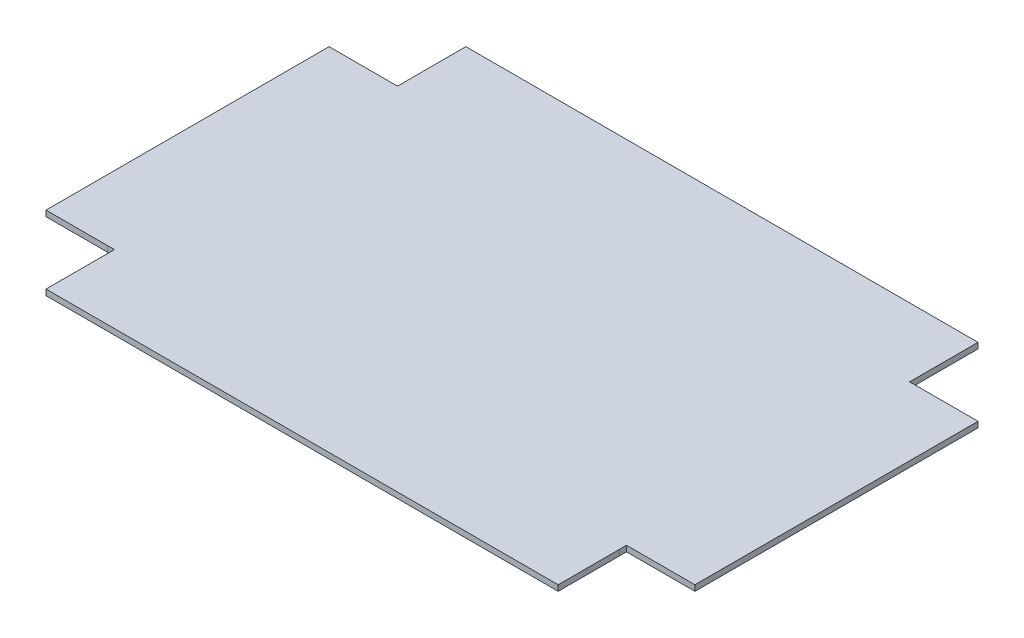
ISO-10303-21;
HEADER;
FILE_DESCRIPTION(('STEP AP214'),'2;1');
FILE_NAME('part.step','',(''),(''),'','','');
FILE_SCHEMA(('AUTOMOTIVE_DESIGN { 1 0 10303 214 1 1 1 1 }'));
ENDSEC;
DATA;
#1=APPLICATION_CONTEXT('core data for automotive mechanical design processes');
#2=APPLICATION_PROTOCOL_DEFINITION('international standard','automotive_design',2000,#1);
#3=PRODUCT_CONTEXT('',#1,'mechanical');
#4=PRODUCT('Part','Part','',(#3));
#5=PRODUCT_RELATED_PRODUCT_CATEGORY('part','',(#4));
#6=PRODUCT_DEFINITION_FORMATION('','',#4);
#7=PRODUCT_DEFINITION_CONTEXT('part definition',#1,'design');
#8=PRODUCT_DEFINITION('design','',#6,#7);
#9=PRODUCT_DEFINITION_SHAPE('','',#8);
#10=(LENGTH_UNIT() NAMED_UNIT(*) SI_UNIT(.MILLI.,.METRE.));
#11=(NAMED_UNIT(*) PLANE_ANGLE_UNIT() SI_UNIT($,.RADIAN.));
#12=(NAMED_UNIT(*) SI_UNIT($,.STERADIAN.) SOLID_ANGLE_UNIT());
#13=UNCERTAINTY_MEASURE_WITH_UNIT(LENGTH_MEASURE(1.E-05),#10,'distance_accuracy_value','');
#14=(GEOMETRIC_REPRESENTATION_CONTEXT(3) GLOBAL_UNCERTAINTY_ASSIGNED_CONTEXT((#13)) GLOBAL_UNIT_ASSIGNED_CONTEXT((#10,
#11,#12)) REPRESENTATION_CONTEXT('',''));
#15=CARTESIAN_POINT('',(0.,0.,0.));
#16=DIRECTION('',(0.,0.,1.));
#17=DIRECTION('',(1.,0.,0.));
#18=AXIS2_PLACEMENT_3D('',#15,#16,#17);
#19=CARTESIAN_POINT('',(0.,2.5,0.));
#20=DIRECTION('',(0.,-1.,0.));
#21=DIRECTION('',(0.,0.,-1.));
#22=AXIS2_PLACEMENT_3D('',#19,#20,#21);
#23=PLANE('',#22);
#24=DIRECTION('',(0.999955339391165,0.,-0.00945088477867864));
#25=VECTOR('',#24,1.);
#26=CARTESIAN_POINT('',(0.116056017189256,2.5,-3.20710678118655));
#27=LINE('',#26,#25);
#28=CARTESIAN_POINT('',(0.116056017189244,2.5,-3.20710678118655));
#29=VERTEX_POINT('',#28);
#30=CARTESIAN_POINT('',(3.2366,2.5,-3.23659999999999));
#31=VERTEX_POINT('',#30);
#32=EDGE_CURVE('E492',#29,#31,#27,.T.);
#33=ORIENTED_EDGE('',*,*,#32,.T.);
#34=DIRECTION('',(0.707106781186376,-5.09482385715369E-13,-0.707106781186719));
#35=VECTOR('',#34,1.);
#36=CARTESIAN_POINT('',(3.22185339059326,2.50000000000001,-3.22185339059327));
#37=LINE('',#36,#35);
#38=CARTESIAN_POINT('',(3.20710678118655,2.50000000000002,-3.20710678118654));
#39=VERTEX_POINT('',#38);
#40=EDGE_CURVE('E251',#39,#31,#37,.T.);
#41=ORIENTED_EDGE('',*,*,#40,.F.);
#42=DIRECTION('',(0.,0.,1.));
#43=VECTOR('',#42,1.);
#44=CARTESIAN_POINT('',(3.20710678118655,2.50000000000001,-3.35265601718925));
#45=LINE('',#44,#43);
#46=CARTESIAN_POINT('',(3.20710678118655,2.4999999999999,26.6473439828108));
#47=VERTEX_POINT('',#46);
#48=EDGE_CURVE('E403',#39,#47,#45,.T.);
#49=ORIENTED_EDGE('',*,*,#48,.T.);
#50=DIRECTION('',(1.,0.,0.));
#51=VECTOR('',#50,1.);
#52=CARTESIAN_POINT('',(0.,2.4999999999999,26.6473439828108));
#53=LINE('',#52,#51);
#54=CARTESIAN_POINT('',(226.792893218813,2.4999999999999,26.6473439828108));
#55=VERTEX_POINT('',#54);
#56=EDGE_CURVE('E448',#55,#47,#53,.F.);
#57=ORIENTED_EDGE('',*,*,#56,.F.);
#58=DIRECTION('',(0.,0.,-1.));
#59=VECTOR('',#58,1.);
#60=CARTESIAN_POINT('',(226.792893218813,2.5,-0.852656017189249));
#61=LINE('',#60,#59);
#62=CARTESIAN_POINT('',(226.792893218813,2.5,-0.116056017189252));
#63=VERTEX_POINT('',#62);
#64=EDGE_CURVE('E291',#63,#55,#61,.F.);
#65=ORIENTED_EDGE('',*,*,#64,.F.);
#66=DIRECTION('',(-0.00945088477868086,0.,-0.999955339391165));
#67=VECTOR('',#66,1.);
#68=CARTESIAN_POINT('',(226.792893218813,2.5,-0.116056017189257));
#69=LINE('',#68,#67);
#70=CARTESIAN_POINT('',(226.7634,2.5,-3.23660000000002));
#71=VERTEX_POINT('',#70);
#72=EDGE_CURVE('E294',#63,#71,#69,.T.);
#73=ORIENTED_EDGE('',*,*,#72,.T.);
#74=DIRECTION('',(-0.707106781186501,0.,-0.707106781186594));
#75=VECTOR('',#74,1.);
#76=CARTESIAN_POINT('',(226.778146609407,2.50000000000001,-3.22185339059327));
#77=LINE('',#76,#75);
#78=CARTESIAN_POINT('',(226.792893218813,2.50000000000001,-3.20710678118654));
#79=VERTEX_POINT('',#78);
#80=EDGE_CURVE('E428',#79,#71,#77,.T.);
#81=ORIENTED_EDGE('',*,*,#80,.F.);
#82=DIRECTION('',(1.,0.,0.));
#83=VECTOR('',#82,1.);
#84=CARTESIAN_POINT('',(226.64734398281,2.5,-3.20710678118654));
#85=LINE('',#84,#83);
#86=CARTESIAN_POINT('',(256.647343982811,2.49999999999981,-3.20710678118654));
#87=VERTEX_POINT('',#86);
#88=EDGE_CURVE('E467',#79,#87,#85,.T.);
#89=ORIENTED_EDGE('',*,*,#88,.T.);
#90=DIRECTION('',(0.,0.,-1.));
#91=VECTOR('',#90,1.);
#92=CARTESIAN_POINT('',(256.647343982811,2.49999999999981,0.));
#93=LINE('',#92,#91);
#94=CARTESIAN_POINT('',(256.647343982811,2.49999999999981,-126.792893218813));
#95=VERTEX_POINT('',#94);
#96=EDGE_CURVE('E464',#95,#87,#93,.F.);
#97=ORIENTED_EDGE('',*,*,#96,.F.);
#98=DIRECTION('',(-1.,0.,0.));
#99=VECTOR('',#98,1.);
#100=CARTESIAN_POINT('',(229.147343982811,2.5,-126.792893218813));
#101=LINE('',#100,#99);
#102=CARTESIAN_POINT('',(229.883943982811,2.5,-126.792893218813));
#103=VERTEX_POINT('',#102);
#104=EDGE_CURVE('E460',#103,#95,#101,.F.);
#105=ORIENTED_EDGE('',*,*,#104,.F.);
#106=DIRECTION('',(-0.999955339391165,0.,0.00945088477868083));
#107=VECTOR('',#106,1.);
#108=CARTESIAN_POINT('',(229.883943982811,2.5,-126.792893218813));
#109=LINE('',#108,#107);
#110=CARTESIAN_POINT('',(226.7634,2.5,-126.7634));
#111=VERTEX_POINT('',#110);
#112=EDGE_CURVE('E449',#103,#111,#109,.T.);
#113=ORIENTED_EDGE('',*,*,#112,.T.);
#114=DIRECTION('',(-0.707106781186547,-1.03975997084704E-13,0.707106781186547));
#115=VECTOR('',#114,1.);
#116=CARTESIAN_POINT('',(226.778146609407,2.5,-126.778146609407));
#117=LINE('',#116,#115);
#118=CARTESIAN_POINT('',(226.792893218813,2.5,-126.792893218813));
#119=VERTEX_POINT('',#118);
#120=EDGE_CURVE('E422',#119,#111,#117,.T.);
#121=ORIENTED_EDGE('',*,*,#120,.F.);
#122=DIRECTION('',(0.,0.,-1.));
#123=VECTOR('',#122,1.);
#124=CARTESIAN_POINT('',(226.792893218813,2.5,-126.64734398281));
#125=LINE('',#124,#123);
#126=CARTESIAN_POINT('',(226.792893218813,2.49999999999981,-156.647343982811));
#127=VERTEX_POINT('',#126);
#128=EDGE_CURVE('E494',#119,#127,#125,.T.);
#129=ORIENTED_EDGE('',*,*,#128,.T.);
#130=DIRECTION('',(-1.,0.,0.));
#131=VECTOR('',#130,1.);
#132=CARTESIAN_POINT('',(230.,2.49999999999981,-156.647343982811));
#133=LINE('',#132,#131);
#134=CARTESIAN_POINT('',(3.20710678118655,2.49999999999981,-156.647343982811));
#135=VERTEX_POINT('',#134);
#136=EDGE_CURVE('E491',#135,#127,#133,.F.);
#137=ORIENTED_EDGE('',*,*,#136,.F.);
#138=DIRECTION('',(0.,0.,1.));
#139=VECTOR('',#138,1.);
#140=CARTESIAN_POINT('',(3.20710678118654,2.5,-129.147343982811));
#141=LINE('',#140,#139);
#142=CARTESIAN_POINT('',(3.20710678118655,2.5,-129.883943982811));
#143=VERTEX_POINT('',#142);
#144=EDGE_CURVE('E487',#143,#135,#141,.F.);
#145=ORIENTED_EDGE('',*,*,#144,.F.);
#146=DIRECTION('',(0.00945088477868091,0.,0.999955339391165));
#147=VECTOR('',#146,1.);
#148=CARTESIAN_POINT('',(3.20710678118655,2.5,-129.883943982811));
#149=LINE('',#148,#147);
#150=CARTESIAN_POINT('',(3.2366,2.5,-126.7634));
#151=VERTEX_POINT('',#150);
#152=EDGE_CURVE('E465',#143,#151,#149,.T.);
#153=ORIENTED_EDGE('',*,*,#152,.T.);
#154=DIRECTION('',(0.707106781186496,0.,0.7071067811866));
#155=VECTOR('',#154,1.);
#156=CARTESIAN_POINT('',(3.22185339059327,2.5,-126.778146609407));
#157=LINE('',#156,#155);
#158=CARTESIAN_POINT('',(3.20710678118654,2.5,-126.792893218813));
#159=VERTEX_POINT('',#158);
#160=EDGE_CURVE('E412',#159,#151,#157,.T.);
#161=ORIENTED_EDGE('',*,*,#160,.F.);
#162=DIRECTION('',(-1.,0.,0.));
#163=VECTOR('',#162,1.);
#164=CARTESIAN_POINT('',(3.35265601718923,2.50000000000002,-126.792893218813));
#165=LINE('',#164,#163);
#166=CARTESIAN_POINT('',(-26.6473439828108,2.49999999999981,-126.792893218813));
#167=VERTEX_POINT('',#166);
#168=EDGE_CURVE('E521',#159,#167,#165,.T.);
#169=ORIENTED_EDGE('',*,*,#168,.T.);
#170=DIRECTION('',(0.,0.,1.));
#171=VECTOR('',#170,1.);
#172=CARTESIAN_POINT('',(-26.6473439828108,2.49999999999981,-130.));
#173=LINE('',#172,#171);
#174=CARTESIAN_POINT('',(-26.6473439828108,2.49999999999981,-3.20710678118655));
#175=VERTEX_POINT('',#174);
#176=EDGE_CURVE('E519',#175,#167,#173,.F.);
#177=ORIENTED_EDGE('',*,*,#176,.F.);
#178=DIRECTION('',(1.,0.,0.));
#179=VECTOR('',#178,1.);
#180=CARTESIAN_POINT('',(0.852656017189242,2.5,-3.20710678118654));
#181=LINE('',#180,#179);
#182=EDGE_CURVE('E514',#29,#175,#181,.F.);
#183=ORIENTED_EDGE('',*,*,#182,.F.);
#184=EDGE_LOOP('',(#33,#41,#49,#57,#65,#73,#81,#89,#97,#105,#113,#121,#129,#137,#145,#153,#161,
#169,#177,#183));
#185=FACE_BOUND('',#184,.T.);
#186=ADVANCED_FACE('F247',(#185),#23,.F.);
#187=CARTESIAN_POINT('',(0.,0.,0.));
#188=DIRECTION('',(0.,-1.,0.));
#189=DIRECTION('',(0.,0.,-1.));
#190=AXIS2_PLACEMENT_3D('',#187,#188,#189);
#191=PLANE('',#190);
#192=DIRECTION('',(-0.707106781186547,-1.03975997084704E-13,0.707106781186547));
#193=VECTOR('',#192,1.);
#194=CARTESIAN_POINT('',(226.778146609407,0.,-126.778146609407));
#195=LINE('',#194,#193);
#196=CARTESIAN_POINT('',(226.792893218813,0.,-126.792893218813));
#197=VERTEX_POINT('',#196);
#198=CARTESIAN_POINT('',(226.7634,0.,-126.7634));
#199=VERTEX_POINT('',#198);
#200=EDGE_CURVE('E425',#197,#199,#195,.T.);
#201=ORIENTED_EDGE('',*,*,#200,.T.);
#202=DIRECTION('',(-0.999955339391165,0.,0.00945088477868083));
#203=VECTOR('',#202,1.);
#204=CARTESIAN_POINT('',(229.883943982811,0.,-126.792893218813));
#205=LINE('',#204,#203);
#206=CARTESIAN_POINT('',(229.883943982811,0.,-126.792893218813));
#207=VERTEX_POINT('',#206);
#208=EDGE_CURVE('E458',#207,#199,#205,.T.);
#209=ORIENTED_EDGE('',*,*,#208,.F.);
#210=DIRECTION('',(1.,0.,0.));
#211=VECTOR('',#210,1.);
#212=CARTESIAN_POINT('',(226.64734398281,0.,-126.792893218813));
#213=LINE('',#212,#211);
#214=CARTESIAN_POINT('',(256.647343982811,-1.94289029309402E-13,-126.792893218813));
#215=VERTEX_POINT('',#214);
#216=EDGE_CURVE('E476',#207,#215,#213,.T.);
#217=ORIENTED_EDGE('',*,*,#216,.T.);
#218=DIRECTION('',(0.,0.,1.));
#219=VECTOR('',#218,1.);
#220=CARTESIAN_POINT('',(256.647343982811,-1.94289029309402E-13,0.));
#221=LINE('',#220,#219);
#222=CARTESIAN_POINT('',(256.647343982811,-1.94289029309402E-13,-3.20710678118654));
#223=VERTEX_POINT('',#222);
#224=EDGE_CURVE('E478',#215,#223,#221,.T.);
#225=ORIENTED_EDGE('',*,*,#224,.T.);
#226=DIRECTION('',(-1.,0.,0.));
#227=VECTOR('',#226,1.);
#228=CARTESIAN_POINT('',(229.147343982811,0.,-3.20710678118654));
#229=LINE('',#228,#227);
#230=CARTESIAN_POINT('',(226.792893218813,0.,-3.20710678118655));
#231=VERTEX_POINT('',#230);
#232=EDGE_CURVE('E470',#231,#223,#229,.F.);
#233=ORIENTED_EDGE('',*,*,#232,.F.);
#234=DIRECTION('',(-0.707106781186501,0.,-0.707106781186594));
#235=VECTOR('',#234,1.);
#236=CARTESIAN_POINT('',(226.778146609407,0.,-3.22185339059328));
#237=LINE('',#236,#235);
#238=CARTESIAN_POINT('',(226.7634,0.,-3.23660000000002));
#239=VERTEX_POINT('',#238);
#240=EDGE_CURVE('E431',#231,#239,#237,.T.);
#241=ORIENTED_EDGE('',*,*,#240,.T.);
#242=DIRECTION('',(-0.00945088477868086,0.,-0.999955339391165));
#243=VECTOR('',#242,1.);
#244=CARTESIAN_POINT('',(226.792893218813,0.,-0.116056017189257));
#245=LINE('',#244,#243);
#246=CARTESIAN_POINT('',(226.792893218813,0.,-0.116056017189261));
#247=VERTEX_POINT('',#246);
#248=EDGE_CURVE('E443',#247,#239,#245,.T.);
#249=ORIENTED_EDGE('',*,*,#248,.F.);
#250=DIRECTION('',(0.,0.,1.));
#251=VECTOR('',#250,1.);
#252=CARTESIAN_POINT('',(226.792893218813,0.,-3.35265601718926));
#253=LINE('',#252,#251);
#254=CARTESIAN_POINT('',(226.792893218813,0.,26.6473439828107));
#255=VERTEX_POINT('',#254);
#256=EDGE_CURVE('E283',#247,#255,#253,.T.);
#257=ORIENTED_EDGE('',*,*,#256,.T.);
#258=DIRECTION('',(-1.,0.,0.));
#259=VECTOR('',#258,1.);
#260=CARTESIAN_POINT('',(0.,0.,26.6473439828107));
#261=LINE('',#260,#259);
#262=CARTESIAN_POINT('',(3.20710678118655,0.,26.6473439828107));
#263=VERTEX_POINT('',#262);
#264=EDGE_CURVE('E266',#255,#263,#261,.T.);
#265=ORIENTED_EDGE('',*,*,#264,.T.);
#266=DIRECTION('',(0.,0.,-1.));
#267=VECTOR('',#266,1.);
#268=CARTESIAN_POINT('',(3.20710678118655,0.,-0.852656017189258));
#269=LINE('',#268,#267);
#270=CARTESIAN_POINT('',(3.20710678118656,0.,-3.20710678118654));
#271=VERTEX_POINT('',#270);
#272=EDGE_CURVE('E393',#271,#263,#269,.F.);
#273=ORIENTED_EDGE('',*,*,#272,.F.);
#274=DIRECTION('',(0.707106781186376,-5.09482385715369E-13,-0.707106781186719));
#275=VECTOR('',#274,1.);
#276=CARTESIAN_POINT('',(3.22185339059328,0.,-3.22185339059327));
#277=LINE('',#276,#275);
#278=CARTESIAN_POINT('',(3.2366,0.,-3.23659999999999));
#279=VERTEX_POINT('',#278);
#280=EDGE_CURVE('E398',#271,#279,#277,.T.);
#281=ORIENTED_EDGE('',*,*,#280,.T.);
#282=DIRECTION('',(0.999955339391165,0.,-0.00945088477867864));
#283=VECTOR('',#282,1.);
#284=CARTESIAN_POINT('',(0.116056017189256,0.,-3.20710678118655));
#285=LINE('',#284,#283);
#286=CARTESIAN_POINT('',(0.116056017189262,0.,-3.20710678118655));
#287=VERTEX_POINT('',#286);
#288=EDGE_CURVE('E512',#287,#279,#285,.T.);
#289=ORIENTED_EDGE('',*,*,#288,.F.);
#290=DIRECTION('',(-1.,0.,0.));
#291=VECTOR('',#290,1.);
#292=CARTESIAN_POINT('',(3.35265601718926,0.,-3.20710678118654));
#293=LINE('',#292,#291);
#294=CARTESIAN_POINT('',(-26.6473439828107,-1.89973241225849E-13,-3.20710678118655));
#295=VERTEX_POINT('',#294);
#296=EDGE_CURVE('E530',#287,#295,#293,.T.);
#297=ORIENTED_EDGE('',*,*,#296,.T.);
#298=DIRECTION('',(0.,0.,-1.));
#299=VECTOR('',#298,1.);
#300=CARTESIAN_POINT('',(-26.6473439828107,-1.89973241225849E-13,0.));
#301=LINE('',#300,#299);
#302=CARTESIAN_POINT('',(-26.6473439828107,-1.89954214582446E-13,-126.792893218813));
#303=VERTEX_POINT('',#302);
#304=EDGE_CURVE('E532',#295,#303,#301,.T.);
#305=ORIENTED_EDGE('',*,*,#304,.T.);
#306=DIRECTION('',(1.,0.,0.));
#307=VECTOR('',#306,1.);
#308=CARTESIAN_POINT('',(0.852656017189259,0.,-126.792893218813));
#309=LINE('',#308,#307);
#310=CARTESIAN_POINT('',(3.20710678118654,0.,-126.792893218813));
#311=VERTEX_POINT('',#310);
#312=EDGE_CURVE('E524',#311,#303,#309,.F.);
#313=ORIENTED_EDGE('',*,*,#312,.F.);
#314=DIRECTION('',(0.707106781186496,0.,0.7071067811866));
#315=VECTOR('',#314,1.);
#316=CARTESIAN_POINT('',(3.22185339059327,0.,-126.778146609407));
#317=LINE('',#316,#315);
#318=CARTESIAN_POINT('',(3.2366,0.,-126.7634));
#319=VERTEX_POINT('',#318);
#320=EDGE_CURVE('E418',#311,#319,#317,.T.);
#321=ORIENTED_EDGE('',*,*,#320,.T.);
#322=DIRECTION('',(0.00945088477868091,0.,0.999955339391165));
#323=VECTOR('',#322,1.);
#324=CARTESIAN_POINT('',(3.20710678118655,0.,-129.883943982811));
#325=LINE('',#324,#323);
#326=CARTESIAN_POINT('',(3.20710678118654,0.,-129.883943982811));
#327=VERTEX_POINT('',#326);
#328=EDGE_CURVE('E485',#327,#319,#325,.T.);
#329=ORIENTED_EDGE('',*,*,#328,.F.);
#330=DIRECTION('',(0.,0.,-1.));
#331=VECTOR('',#330,1.);
#332=CARTESIAN_POINT('',(3.20710678118654,0.,-126.64734398281));
#333=LINE('',#332,#331);
#334=CARTESIAN_POINT('',(3.20710678118655,-1.94289029309402E-13,-156.647343982811));
#335=VERTEX_POINT('',#334);
#336=EDGE_CURVE('E503',#327,#335,#333,.T.);
#337=ORIENTED_EDGE('',*,*,#336,.T.);
#338=DIRECTION('',(1.,0.,0.));
#339=VECTOR('',#338,1.);
#340=CARTESIAN_POINT('',(0.,-1.94289029309402E-13,-156.647343982811));
#341=LINE('',#340,#339);
#342=CARTESIAN_POINT('',(226.792893218813,-1.94289029309402E-13,-156.647343982811));
#343=VERTEX_POINT('',#342);
#344=EDGE_CURVE('E505',#335,#343,#341,.T.);
#345=ORIENTED_EDGE('',*,*,#344,.T.);
#346=DIRECTION('',(0.,0.,1.));
#347=VECTOR('',#346,1.);
#348=CARTESIAN_POINT('',(226.792893218813,0.,-129.147343982811));
#349=LINE('',#348,#347);
#350=EDGE_CURVE('E497',#197,#343,#349,.F.);
#351=ORIENTED_EDGE('',*,*,#350,.F.);
#352=EDGE_LOOP('',(#201,#209,#217,#225,#233,#241,#249,#257,#265,#273,#281,#289,#297,#305,#313,
#321,#329,#337,#345,#351));
#353=FACE_BOUND('',#352,.T.);
#354=ADVANCED_FACE('F249',(#353),#191,.T.);
#355=CARTESIAN_POINT('',(226.792893218813,1.25,-0.116056017189257));
#356=DIRECTION('',(0.999955339391165,0.,-0.00945088477868086));
#357=DIRECTION('',(-0.00945088477868086,0.,-0.999955339391165));
#358=AXIS2_PLACEMENT_3D('',#355,#356,#357);
#359=PLANE('',#358);
#360=ORIENTED_EDGE('',*,*,#248,.T.);
#361=DIRECTION('',(0.,-1.,0.));
#362=VECTOR('',#361,1.);
#363=CARTESIAN_POINT('',(226.7634,2.5,-3.23660000000001));
#364=LINE('',#363,#362);
#365=EDGE_CURVE('E440',#71,#239,#364,.T.);
#366=ORIENTED_EDGE('',*,*,#365,.F.);
#367=ORIENTED_EDGE('',*,*,#72,.F.);
#368=DIRECTION('',(0.,1.,0.));
#369=VECTOR('',#368,1.);
#370=CARTESIAN_POINT('',(226.792893218813,2.5,-0.116056017189252));
#371=LINE('',#370,#369);
#372=EDGE_CURVE('E455',#247,#63,#371,.T.);
#373=ORIENTED_EDGE('',*,*,#372,.F.);
#374=EDGE_LOOP('',(#360,#366,#367,#373));
#375=FACE_BOUND('',#374,.T.);
#376=ADVANCED_FACE('F574',(#375),#359,.T.);
#377=CARTESIAN_POINT('',(0.,0.,26.6473439828107));
#378=DIRECTION('',(0.,0.,-1.));
#379=DIRECTION('',(0.,1.,0.));
#380=AXIS2_PLACEMENT_3D('',#377,#378,#379);
#381=PLANE('',#380);
#382=ORIENTED_EDGE('',*,*,#264,.F.);
#383=DIRECTION('',(0.,1.,0.));
#384=VECTOR('',#383,1.);
#385=CARTESIAN_POINT('',(226.792893218813,0.,26.6473439828107));
#386=LINE('',#385,#384);
#387=EDGE_CURVE('E446',#255,#55,#386,.T.);
#388=ORIENTED_EDGE('',*,*,#387,.T.);
#389=ORIENTED_EDGE('',*,*,#56,.T.);
#390=DIRECTION('',(0.,-1.,0.));
#391=VECTOR('',#390,1.);
#392=CARTESIAN_POINT('',(3.20710678118655,2.4999999999999,26.6473439828108));
#393=LINE('',#392,#391);
#394=EDGE_CURVE('E402',#263,#47,#393,.F.);
#395=ORIENTED_EDGE('',*,*,#394,.F.);
#396=EDGE_LOOP('',(#382,#388,#389,#395));
#397=FACE_BOUND('',#396,.T.);
#398=ADVANCED_FACE('F625',(#397),#381,.F.);
#399=CARTESIAN_POINT('',(3.20710678118655,2.5,-0.852656017189249));
#400=DIRECTION('',(-1.,0.,0.));
#401=DIRECTION('',(0.,-1.,0.));
#402=AXIS2_PLACEMENT_3D('',#399,#400,#401);
#403=PLANE('',#402);
#404=ORIENTED_EDGE('',*,*,#272,.T.);
#405=ORIENTED_EDGE('',*,*,#394,.T.);
#406=ORIENTED_EDGE('',*,*,#48,.F.);
#407=DIRECTION('',(0.,1.,0.));
#408=VECTOR('',#407,1.);
#409=CARTESIAN_POINT('',(3.20710678118656,0.,-3.20710678118654));
#410=LINE('',#409,#408);
#411=EDGE_CURVE('E406',#271,#39,#410,.T.);
#412=ORIENTED_EDGE('',*,*,#411,.F.);
#413=EDGE_LOOP('',(#404,#405,#406,#412));
#414=FACE_BOUND('',#413,.T.);
#415=ADVANCED_FACE('F407',(#414),#403,.T.);
#416=CARTESIAN_POINT('',(226.792893218813,2.5,-0.852656017189249));
#417=DIRECTION('',(-1.,0.,0.));
#418=DIRECTION('',(0.,-1.,0.));
#419=AXIS2_PLACEMENT_3D('',#416,#417,#418);
#420=PLANE('',#419);
#421=ORIENTED_EDGE('',*,*,#387,.F.);
#422=ORIENTED_EDGE('',*,*,#256,.F.);
#423=ORIENTED_EDGE('',*,*,#372,.T.);
#424=ORIENTED_EDGE('',*,*,#64,.T.);
#425=EDGE_LOOP('',(#421,#422,#423,#424));
#426=FACE_BOUND('',#425,.T.);
#427=ADVANCED_FACE('F571',(#426),#420,.F.);
#428=CARTESIAN_POINT('',(229.883943982811,1.25,-126.792893218813));
#429=DIRECTION('',(-0.00945088477868083,0.,-0.999955339391165));
#430=DIRECTION('',(-0.999955339391165,0.,0.00945088477868083));
#431=AXIS2_PLACEMENT_3D('',#428,#429,#430);
#432=PLANE('',#431);
#433=ORIENTED_EDGE('',*,*,#208,.T.);
#434=DIRECTION('',(0.,-1.,0.));
#435=VECTOR('',#434,1.);
#436=CARTESIAN_POINT('',(226.7634,2.5,-126.7634));
#437=LINE('',#436,#435);
#438=EDGE_CURVE('E437',#111,#199,#437,.T.);
#439=ORIENTED_EDGE('',*,*,#438,.F.);
#440=ORIENTED_EDGE('',*,*,#112,.F.);
#441=DIRECTION('',(0.,1.,0.));
#442=VECTOR('',#441,1.);
#443=CARTESIAN_POINT('',(229.883943982811,2.5,-126.792893218813));
#444=LINE('',#443,#442);
#445=EDGE_CURVE('E480',#207,#103,#444,.T.);
#446=ORIENTED_EDGE('',*,*,#445,.F.);
#447=EDGE_LOOP('',(#433,#439,#440,#446));
#448=FACE_BOUND('',#447,.T.);
#449=ADVANCED_FACE('F594',(#448),#432,.T.);
#450=CARTESIAN_POINT('',(256.647343982811,-1.94289029309402E-13,0.));
#451=DIRECTION('',(-1.,0.,0.));
#452=DIRECTION('',(0.,-1.,0.));
#453=AXIS2_PLACEMENT_3D('',#450,#451,#452);
#454=PLANE('',#453);
#455=ORIENTED_EDGE('',*,*,#224,.F.);
#456=DIRECTION('',(0.,1.,0.));
#457=VECTOR('',#456,1.);
#458=CARTESIAN_POINT('',(256.647343982811,-1.94289029309402E-13,-126.792893218813));
#459=LINE('',#458,#457);
#460=EDGE_CURVE('E462',#215,#95,#459,.T.);
#461=ORIENTED_EDGE('',*,*,#460,.T.);
#462=ORIENTED_EDGE('',*,*,#96,.T.);
#463=DIRECTION('',(0.,-1.,0.));
#464=VECTOR('',#463,1.);
#465=CARTESIAN_POINT('',(256.647343982811,2.49999999999981,-3.20710678118654));
#466=LINE('',#465,#464);
#467=EDGE_CURVE('E473',#223,#87,#466,.F.);
#468=ORIENTED_EDGE('',*,*,#467,.F.);
#469=EDGE_LOOP('',(#455,#461,#462,#468));
#470=FACE_BOUND('',#469,.T.);
#471=ADVANCED_FACE('F585',(#470),#454,.F.);
#472=CARTESIAN_POINT('',(229.147343982811,2.5,-3.20710678118654));
#473=DIRECTION('',(0.,0.,1.));
#474=DIRECTION('',(-1.,0.,0.));
#475=AXIS2_PLACEMENT_3D('',#472,#473,#474);
#476=PLANE('',#475);
#477=ORIENTED_EDGE('',*,*,#232,.T.);
#478=ORIENTED_EDGE('',*,*,#467,.T.);
#479=ORIENTED_EDGE('',*,*,#88,.F.);
#480=DIRECTION('',(0.,1.,0.));
#481=VECTOR('',#480,1.);
#482=CARTESIAN_POINT('',(226.792893218813,0.,-3.20710678118655));
#483=LINE('',#482,#481);
#484=EDGE_CURVE('E433',#231,#79,#483,.T.);
#485=ORIENTED_EDGE('',*,*,#484,.F.);
#486=EDGE_LOOP('',(#477,#478,#479,#485));
#487=FACE_BOUND('',#486,.T.);
#488=ADVANCED_FACE('F581',(#487),#476,.T.);
#489=CARTESIAN_POINT('',(229.147343982811,2.5,-126.792893218813));
#490=DIRECTION('',(0.,0.,1.));
#491=DIRECTION('',(-1.,0.,0.));
#492=AXIS2_PLACEMENT_3D('',#489,#490,#491);
#493=PLANE('',#492);
#494=ORIENTED_EDGE('',*,*,#460,.F.);
#495=ORIENTED_EDGE('',*,*,#216,.F.);
#496=ORIENTED_EDGE('',*,*,#445,.T.);
#497=ORIENTED_EDGE('',*,*,#104,.T.);
#498=EDGE_LOOP('',(#494,#495,#496,#497));
#499=FACE_BOUND('',#498,.T.);
#500=ADVANCED_FACE('F588',(#499),#493,.F.);
#501=CARTESIAN_POINT('',(3.20710678118655,1.25,-129.883943982811));
#502=DIRECTION('',(-0.999955339391165,0.,0.00945088477868091));
#503=DIRECTION('',(0.00945088477868091,0.,0.999955339391165));
#504=AXIS2_PLACEMENT_3D('',#501,#502,#503);
#505=PLANE('',#504);
#506=ORIENTED_EDGE('',*,*,#328,.T.);
#507=DIRECTION('',(0.,-1.,0.));
#508=VECTOR('',#507,1.);
#509=CARTESIAN_POINT('',(3.2366,2.5,-126.7634));
#510=LINE('',#509,#508);
#511=EDGE_CURVE('E257',#151,#319,#510,.T.);
#512=ORIENTED_EDGE('',*,*,#511,.F.);
#513=ORIENTED_EDGE('',*,*,#152,.F.);
#514=DIRECTION('',(0.,1.,0.));
#515=VECTOR('',#514,1.);
#516=CARTESIAN_POINT('',(3.20710678118654,2.5,-129.883943982811));
#517=LINE('',#516,#515);
#518=EDGE_CURVE('E507',#327,#143,#517,.T.);
#519=ORIENTED_EDGE('',*,*,#518,.F.);
#520=EDGE_LOOP('',(#506,#512,#513,#519));
#521=FACE_BOUND('',#520,.T.);
#522=ADVANCED_FACE('F556',(#521),#505,.T.);
#523=CARTESIAN_POINT('',(230.,-1.94289029309402E-13,-156.647343982811));
#524=DIRECTION('',(0.,0.,1.));
#525=DIRECTION('',(0.,-1.,0.));
#526=AXIS2_PLACEMENT_3D('',#523,#524,#525);
#527=PLANE('',#526);
#528=ORIENTED_EDGE('',*,*,#344,.F.);
#529=DIRECTION('',(0.,1.,0.));
#530=VECTOR('',#529,1.);
#531=CARTESIAN_POINT('',(3.20710678118655,-1.94289029309402E-13,-156.647343982811));
#532=LINE('',#531,#530);
#533=EDGE_CURVE('E489',#335,#135,#532,.T.);
#534=ORIENTED_EDGE('',*,*,#533,.T.);
#535=ORIENTED_EDGE('',*,*,#136,.T.);
#536=DIRECTION('',(0.,-1.,0.));
#537=VECTOR('',#536,1.);
#538=CARTESIAN_POINT('',(226.792893218813,2.49999999999981,-156.647343982811));
#539=LINE('',#538,#537);
#540=EDGE_CURVE('E500',#343,#127,#539,.F.);
#541=ORIENTED_EDGE('',*,*,#540,.F.);
#542=EDGE_LOOP('',(#528,#534,#535,#541));
#543=FACE_BOUND('',#542,.T.);
#544=ADVANCED_FACE('F608',(#543),#527,.F.);
#545=CARTESIAN_POINT('',(226.792893218813,2.5,-129.147343982811));
#546=DIRECTION('',(1.,0.,0.));
#547=DIRECTION('',(0.,-1.,0.));
#548=AXIS2_PLACEMENT_3D('',#545,#546,#547);
#549=PLANE('',#548);
#550=ORIENTED_EDGE('',*,*,#350,.T.);
#551=ORIENTED_EDGE('',*,*,#540,.T.);
#552=ORIENTED_EDGE('',*,*,#128,.F.);
#553=DIRECTION('',(0.,1.,0.));
#554=VECTOR('',#553,1.);
#555=CARTESIAN_POINT('',(226.792893218813,0.,-126.792893218813));
#556=LINE('',#555,#554);
#557=EDGE_CURVE('E427',#197,#119,#556,.T.);
#558=ORIENTED_EDGE('',*,*,#557,.F.);
#559=EDGE_LOOP('',(#550,#551,#552,#558));
#560=FACE_BOUND('',#559,.T.);
#561=ADVANCED_FACE('F601',(#560),#549,.T.);
#562=CARTESIAN_POINT('',(3.20710678118654,2.5,-129.147343982811));
#563=DIRECTION('',(1.,0.,0.));
#564=DIRECTION('',(0.,-1.,0.));
#565=AXIS2_PLACEMENT_3D('',#562,#563,#564);
#566=PLANE('',#565);
#567=ORIENTED_EDGE('',*,*,#533,.F.);
#568=ORIENTED_EDGE('',*,*,#336,.F.);
#569=ORIENTED_EDGE('',*,*,#518,.T.);
#570=ORIENTED_EDGE('',*,*,#144,.T.);
#571=EDGE_LOOP('',(#567,#568,#569,#570));
#572=FACE_BOUND('',#571,.T.);
#573=ADVANCED_FACE('F606',(#572),#566,.F.);
#574=CARTESIAN_POINT('',(0.116056017189256,1.25,-3.20710678118655));
#575=DIRECTION('',(0.00945088477867864,0.,0.999955339391165));
#576=DIRECTION('',(0.999955339391165,0.,-0.00945088477867864));
#577=AXIS2_PLACEMENT_3D('',#574,#575,#576);
#578=PLANE('',#577);
#579=ORIENTED_EDGE('',*,*,#288,.T.);
#580=DIRECTION('',(0.,-1.,0.));
#581=VECTOR('',#580,1.);
#582=CARTESIAN_POINT('',(3.2366,2.5,-3.2366));
#583=LINE('',#582,#581);
#584=EDGE_CURVE('E14',#31,#279,#583,.T.);
#585=ORIENTED_EDGE('',*,*,#584,.F.);
#586=ORIENTED_EDGE('',*,*,#32,.F.);
#587=DIRECTION('',(0.,1.,0.));
#588=VECTOR('',#587,1.);
#589=CARTESIAN_POINT('',(0.116056017189244,2.5,-3.20710678118654));
#590=LINE('',#589,#588);
#591=EDGE_CURVE('E534',#287,#29,#590,.T.);
#592=ORIENTED_EDGE('',*,*,#591,.F.);
#593=EDGE_LOOP('',(#579,#585,#586,#592));
#594=FACE_BOUND('',#593,.T.);
#595=ADVANCED_FACE('F569',(#594),#578,.T.);
#596=CARTESIAN_POINT('',(-26.6473439828107,-1.89745890488158E-13,-130.));
#597=DIRECTION('',(1.,0.,0.));
#598=DIRECTION('',(0.,1.,0.));
#599=AXIS2_PLACEMENT_3D('',#596,#597,#598);
#600=PLANE('',#599);
#601=ORIENTED_EDGE('',*,*,#304,.F.);
#602=DIRECTION('',(0.,1.,0.));
#603=VECTOR('',#602,1.);
#604=CARTESIAN_POINT('',(-26.6473439828107,-1.89745890488158E-13,-3.20710678118655));
#605=LINE('',#604,#603);
#606=EDGE_CURVE('E517',#295,#175,#605,.T.);
#607=ORIENTED_EDGE('',*,*,#606,.T.);
#608=ORIENTED_EDGE('',*,*,#176,.T.);
#609=DIRECTION('',(0.,-1.,0.));
#610=VECTOR('',#609,1.);
#611=CARTESIAN_POINT('',(-26.6473439828108,2.49999999999981,-126.792893218813));
#612=LINE('',#611,#610);
#613=EDGE_CURVE('E527',#303,#167,#612,.F.);
#614=ORIENTED_EDGE('',*,*,#613,.F.);
#615=EDGE_LOOP('',(#601,#607,#608,#614));
#616=FACE_BOUND('',#615,.T.);
#617=ADVANCED_FACE('F562',(#616),#600,.F.);
#618=CARTESIAN_POINT('',(0.852656017189242,2.5,-126.792893218813));
#619=DIRECTION('',(0.,0.,-1.));
#620=DIRECTION('',(-1.,0.,0.));
#621=AXIS2_PLACEMENT_3D('',#618,#619,#620);
#622=PLANE('',#621);
#623=ORIENTED_EDGE('',*,*,#312,.T.);
#624=ORIENTED_EDGE('',*,*,#613,.T.);
#625=ORIENTED_EDGE('',*,*,#168,.F.);
#626=DIRECTION('',(0.,1.,0.));
#627=VECTOR('',#626,1.);
#628=CARTESIAN_POINT('',(3.20710678118654,0.,-126.792893218813));
#629=LINE('',#628,#627);
#630=EDGE_CURVE('E421',#311,#159,#629,.T.);
#631=ORIENTED_EDGE('',*,*,#630,.F.);
#632=EDGE_LOOP('',(#623,#624,#625,#631));
#633=FACE_BOUND('',#632,.T.);
#634=ADVANCED_FACE('F560',(#633),#622,.T.);
#635=CARTESIAN_POINT('',(0.852656017189242,2.5,-3.20710678118654));
#636=DIRECTION('',(0.,0.,-1.));
#637=DIRECTION('',(-1.,0.,0.));
#638=AXIS2_PLACEMENT_3D('',#635,#636,#637);
#639=PLANE('',#638);
#640=ORIENTED_EDGE('',*,*,#606,.F.);
#641=ORIENTED_EDGE('',*,*,#296,.F.);
#642=ORIENTED_EDGE('',*,*,#591,.T.);
#643=ORIENTED_EDGE('',*,*,#182,.T.);
#644=EDGE_LOOP('',(#640,#641,#642,#643));
#645=FACE_BOUND('',#644,.T.);
#646=ADVANCED_FACE('F565',(#645),#639,.F.);
#647=CARTESIAN_POINT('',(226.792893218813,0.,-3.20710678118655));
#648=DIRECTION('',(0.707106781186594,0.,-0.707106781186501));
#649=DIRECTION('',(-0.707106781186501,0.,-0.707106781186594));
#650=AXIS2_PLACEMENT_3D('',#647,#648,#649);
#651=PLANE('',#650);
#652=ORIENTED_EDGE('',*,*,#80,.T.);
#653=ORIENTED_EDGE('',*,*,#365,.T.);
#654=ORIENTED_EDGE('',*,*,#240,.F.);
#655=ORIENTED_EDGE('',*,*,#484,.T.);
#656=EDGE_LOOP('',(#652,#653,#654,#655));
#657=FACE_BOUND('',#656,.T.);
#658=ADVANCED_FACE('F577',(#657),#651,.F.);
#659=CARTESIAN_POINT('',(226.792893218813,0.,-126.792893218813));
#660=DIRECTION('',(-0.707106781186547,0.,-0.707106781186547));
#661=DIRECTION('',(-0.707106781186548,0.,0.707106781186548));
#662=AXIS2_PLACEMENT_3D('',#659,#660,#661);
#663=PLANE('',#662);
#664=ORIENTED_EDGE('',*,*,#120,.T.);
#665=ORIENTED_EDGE('',*,*,#438,.T.);
#666=ORIENTED_EDGE('',*,*,#200,.F.);
#667=ORIENTED_EDGE('',*,*,#557,.T.);
#668=EDGE_LOOP('',(#664,#665,#666,#667));
#669=FACE_BOUND('',#668,.T.);
#670=ADVANCED_FACE('F598',(#669),#663,.F.);
#671=CARTESIAN_POINT('',(3.20710678118654,0.,-126.792893218813));
#672=DIRECTION('',(-0.7071067811866,0.,0.707106781186496));
#673=DIRECTION('',(0.707106781186496,0.,0.7071067811866));
#674=AXIS2_PLACEMENT_3D('',#671,#672,#673);
#675=PLANE('',#674);
#676=ORIENTED_EDGE('',*,*,#160,.T.);
#677=ORIENTED_EDGE('',*,*,#511,.T.);
#678=ORIENTED_EDGE('',*,*,#320,.F.);
#679=ORIENTED_EDGE('',*,*,#630,.T.);
#680=EDGE_LOOP('',(#676,#677,#678,#679));
#681=FACE_BOUND('',#680,.T.);
#682=ADVANCED_FACE('F548',(#681),#675,.F.);
#683=CARTESIAN_POINT('',(3.20710678118656,0.,-3.20710678118654));
#684=DIRECTION('',(0.707106781186719,0.,0.707106781186376));
#685=DIRECTION('',(0.707106781186376,0.,-0.707106781186719));
#686=AXIS2_PLACEMENT_3D('',#683,#684,#685);
#687=PLANE('',#686);
#688=ORIENTED_EDGE('',*,*,#40,.T.);
#689=ORIENTED_EDGE('',*,*,#584,.T.);
#690=ORIENTED_EDGE('',*,*,#280,.F.);
#691=ORIENTED_EDGE('',*,*,#411,.T.);
#692=EDGE_LOOP('',(#688,#689,#690,#691));
#693=FACE_BOUND('',#692,.T.);
#694=ADVANCED_FACE('F414',(#693),#687,.F.);
#695=CLOSED_SHELL('',(#186,#354,#376,#398,#415,#427,#449,#471,#488,#500,#522,#544,#561,#573,
#595,#617,#634,#646,#658,#670,#682,#694));
#696=MANIFOLD_SOLID_BREP('B2',#695);
#697=ADVANCED_BREP_SHAPE_REPRESENTATION('',(#18,#696),#14);
#698=SHAPE_DEFINITION_REPRESENTATION(#9,#697);
ENDSEC;
END-ISO-10303-21;
